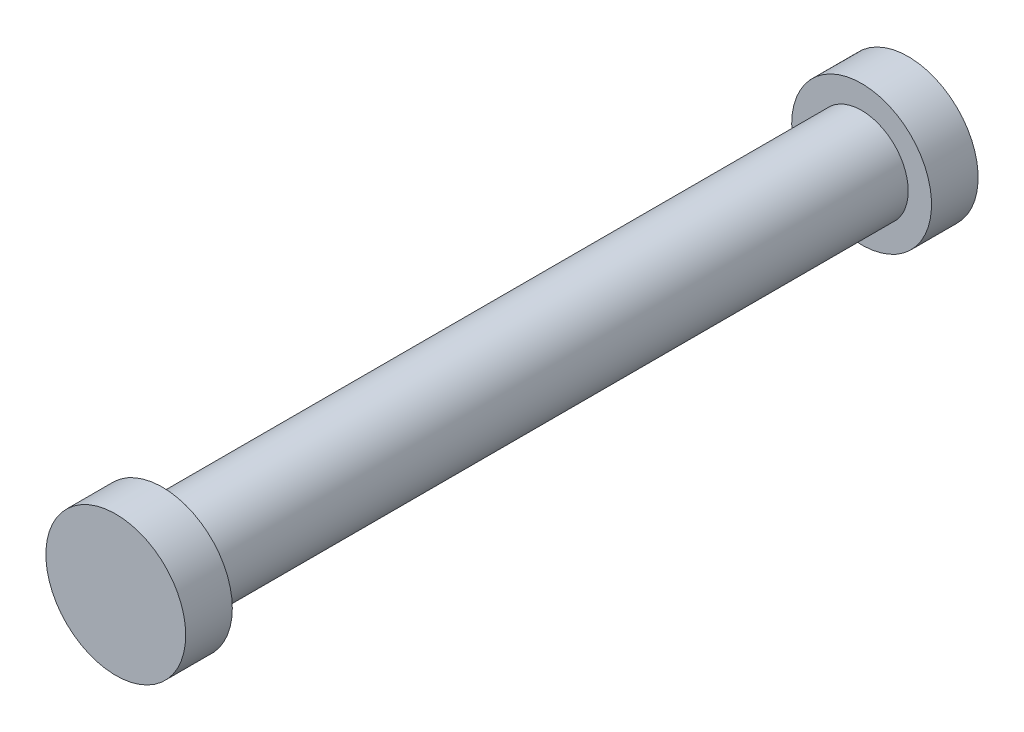
ISO-10303-21;
HEADER;
FILE_DESCRIPTION(('STEP AP214'),'2;1');
FILE_NAME('part.step','',(''),(''),'','','');
FILE_SCHEMA(('AUTOMOTIVE_DESIGN { 1 0 10303 214 1 1 1 1 }'));
ENDSEC;
DATA;
#1=APPLICATION_CONTEXT('core data for automotive mechanical design processes');
#2=APPLICATION_PROTOCOL_DEFINITION('international standard','automotive_design',2000,#1);
#3=PRODUCT_CONTEXT('',#1,'mechanical');
#4=PRODUCT('Part','Part','',(#3));
#5=PRODUCT_RELATED_PRODUCT_CATEGORY('part','',(#4));
#6=PRODUCT_DEFINITION_FORMATION('','',#4);
#7=PRODUCT_DEFINITION_CONTEXT('part definition',#1,'design');
#8=PRODUCT_DEFINITION('design','',#6,#7);
#9=PRODUCT_DEFINITION_SHAPE('','',#8);
#10=(LENGTH_UNIT() NAMED_UNIT(*) SI_UNIT(.MILLI.,.METRE.));
#11=(NAMED_UNIT(*) PLANE_ANGLE_UNIT() SI_UNIT($,.RADIAN.));
#12=(NAMED_UNIT(*) SI_UNIT($,.STERADIAN.) SOLID_ANGLE_UNIT());
#13=UNCERTAINTY_MEASURE_WITH_UNIT(LENGTH_MEASURE(1.E-05),#10,'distance_accuracy_value','');
#14=(GEOMETRIC_REPRESENTATION_CONTEXT(3) GLOBAL_UNCERTAINTY_ASSIGNED_CONTEXT((#13)) GLOBAL_UNIT_ASSIGNED_CONTEXT((#10,
#11,#12)) REPRESENTATION_CONTEXT('',''));
#15=CARTESIAN_POINT('',(0.,0.,0.));
#16=DIRECTION('',(0.,0.,1.));
#17=DIRECTION('',(1.,0.,0.));
#18=AXIS2_PLACEMENT_3D('',#15,#16,#17);
#19=CARTESIAN_POINT('',(0.,0.,-95.25));
#20=DIRECTION('',(0.,0.,1.));
#21=DIRECTION('',(1.,0.,0.));
#22=AXIS2_PLACEMENT_3D('',#19,#20,#21);
#23=CYLINDRICAL_SURFACE('',#22,6.35);
#24=CARTESIAN_POINT('',(0.,0.,-95.25));
#25=DIRECTION('',(0.,0.,-1.));
#26=DIRECTION('',(-1.,0.,0.));
#27=AXIS2_PLACEMENT_3D('',#24,#25,#26);
#28=CIRCLE('',#27,6.35);
#29=CARTESIAN_POINT('',(-6.35,0.,-95.25));
#30=VERTEX_POINT('',#29);
#31=EDGE_CURVE('E46',#30,#30,#28,.F.);
#32=ORIENTED_EDGE('',*,*,#31,.T.);
#33=EDGE_LOOP('',(#32));
#34=FACE_BOUND('',#33,.T.);
#35=CARTESIAN_POINT('',(0.,0.,0.));
#36=DIRECTION('',(0.,0.,1.));
#37=DIRECTION('',(1.,0.,0.));
#38=AXIS2_PLACEMENT_3D('',#35,#36,#37);
#39=CIRCLE('',#38,6.35);
#40=CARTESIAN_POINT('',(6.35,0.,0.));
#41=VERTEX_POINT('',#40);
#42=EDGE_CURVE('E10',#41,#41,#39,.T.);
#43=ORIENTED_EDGE('',*,*,#42,.F.);
#44=EDGE_LOOP('',(#43));
#45=FACE_BOUND('',#44,.T.);
#46=ADVANCED_FACE('F31',(#34,#45),#23,.T.);
#47=CARTESIAN_POINT('',(0.,0.,6.35));
#48=DIRECTION('',(0.,0.,-1.));
#49=DIRECTION('',(-1.,0.,0.));
#50=AXIS2_PLACEMENT_3D('',#47,#48,#49);
#51=CYLINDRICAL_SURFACE('',#50,9.525);
#52=CARTESIAN_POINT('',(0.,0.,6.35));
#53=DIRECTION('',(0.,0.,1.));
#54=DIRECTION('',(1.,0.,0.));
#55=AXIS2_PLACEMENT_3D('',#52,#53,#54);
#56=CIRCLE('',#55,9.525);
#57=CARTESIAN_POINT('',(9.525,0.,6.35));
#58=VERTEX_POINT('',#57);
#59=EDGE_CURVE('E37',#58,#58,#56,.T.);
#60=ORIENTED_EDGE('',*,*,#59,.F.);
#61=EDGE_LOOP('',(#60));
#62=FACE_BOUND('',#61,.T.);
#63=CARTESIAN_POINT('',(0.,0.,0.));
#64=DIRECTION('',(0.,0.,1.));
#65=DIRECTION('',(1.,0.,0.));
#66=AXIS2_PLACEMENT_3D('',#63,#64,#65);
#67=CIRCLE('',#66,9.525);
#68=CARTESIAN_POINT('',(9.525,0.,0.));
#69=VERTEX_POINT('',#68);
#70=EDGE_CURVE('E41',#69,#69,#67,.T.);
#71=ORIENTED_EDGE('',*,*,#70,.T.);
#72=EDGE_LOOP('',(#71));
#73=FACE_BOUND('',#72,.T.);
#74=ADVANCED_FACE('F76',(#62,#73),#51,.T.);
#75=CARTESIAN_POINT('',(0.,0.,6.35));
#76=DIRECTION('',(0.,0.,1.));
#77=DIRECTION('',(1.,0.,0.));
#78=AXIS2_PLACEMENT_3D('',#75,#76,#77);
#79=PLANE('',#78);
#80=ORIENTED_EDGE('',*,*,#59,.T.);
#81=EDGE_LOOP('',(#80));
#82=FACE_BOUND('',#81,.T.);
#83=ADVANCED_FACE('F81',(#82),#79,.T.);
#84=CARTESIAN_POINT('',(0.,0.,0.));
#85=DIRECTION('',(0.,0.,1.));
#86=DIRECTION('',(1.,0.,0.));
#87=AXIS2_PLACEMENT_3D('',#84,#85,#86);
#88=PLANE('',#87);
#89=ORIENTED_EDGE('',*,*,#42,.T.);
#90=EDGE_LOOP('',(#89));
#91=FACE_BOUND('',#90,.T.);
#92=ORIENTED_EDGE('',*,*,#70,.F.);
#93=EDGE_LOOP('',(#92));
#94=FACE_BOUND('',#93,.T.);
#95=ADVANCED_FACE('F62',(#91,#94),#88,.F.);
#96=CARTESIAN_POINT('',(0.,0.,-101.6));
#97=DIRECTION('',(0.,0.,1.));
#98=DIRECTION('',(1.,0.,0.));
#99=AXIS2_PLACEMENT_3D('',#96,#97,#98);
#100=CYLINDRICAL_SURFACE('',#99,9.525);
#101=CARTESIAN_POINT('',(0.,0.,-101.6));
#102=DIRECTION('',(0.,0.,-1.));
#103=DIRECTION('',(-1.,0.,0.));
#104=AXIS2_PLACEMENT_3D('',#101,#102,#103);
#105=CIRCLE('',#104,9.525);
#106=CARTESIAN_POINT('',(-9.525,0.,-101.6));
#107=VERTEX_POINT('',#106);
#108=EDGE_CURVE('E50',#107,#107,#105,.T.);
#109=ORIENTED_EDGE('',*,*,#108,.F.);
#110=EDGE_LOOP('',(#109));
#111=FACE_BOUND('',#110,.T.);
#112=CARTESIAN_POINT('',(0.,0.,-95.25));
#113=DIRECTION('',(0.,0.,-1.));
#114=DIRECTION('',(-1.,0.,0.));
#115=AXIS2_PLACEMENT_3D('',#112,#113,#114);
#116=CIRCLE('',#115,9.525);
#117=CARTESIAN_POINT('',(-9.525,0.,-95.25));
#118=VERTEX_POINT('',#117);
#119=EDGE_CURVE('E51',#118,#118,#116,.T.);
#120=ORIENTED_EDGE('',*,*,#119,.T.);
#121=EDGE_LOOP('',(#120));
#122=FACE_BOUND('',#121,.T.);
#123=ADVANCED_FACE('F59',(#111,#122),#100,.T.);
#124=CARTESIAN_POINT('',(0.,0.,-101.6));
#125=DIRECTION('',(0.,0.,-1.));
#126=DIRECTION('',(-1.,0.,0.));
#127=AXIS2_PLACEMENT_3D('',#124,#125,#126);
#128=PLANE('',#127);
#129=ORIENTED_EDGE('',*,*,#108,.T.);
#130=EDGE_LOOP('',(#129));
#131=FACE_BOUND('',#130,.T.);
#132=ADVANCED_FACE('F57',(#131),#128,.T.);
#133=CARTESIAN_POINT('',(0.,0.,-95.25));
#134=DIRECTION('',(0.,0.,-1.));
#135=DIRECTION('',(-1.,0.,0.));
#136=AXIS2_PLACEMENT_3D('',#133,#134,#135);
#137=PLANE('',#136);
#138=ORIENTED_EDGE('',*,*,#31,.F.);
#139=EDGE_LOOP('',(#138));
#140=FACE_BOUND('',#139,.T.);
#141=ORIENTED_EDGE('',*,*,#119,.F.);
#142=EDGE_LOOP('',(#141));
#143=FACE_BOUND('',#142,.T.);
#144=ADVANCED_FACE('F66',(#140,#143),#137,.F.);
#145=CLOSED_SHELL('',(#46,#74,#83,#95,#123,#132,#144));
#146=MANIFOLD_SOLID_BREP('B2',#145);
#147=ADVANCED_BREP_SHAPE_REPRESENTATION('',(#18,#146),#14);
#148=SHAPE_DEFINITION_REPRESENTATION(#9,#147);
ENDSEC;
END-ISO-10303-21;
